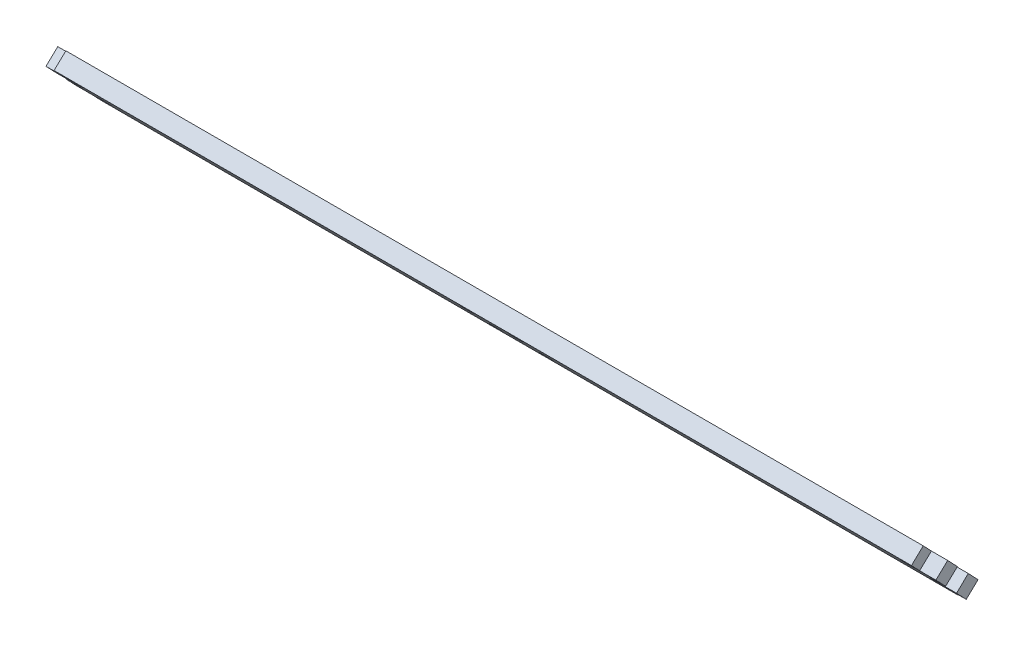
ISO-10303-21;
HEADER;
FILE_DESCRIPTION(('STEP AP214'),'2;1');
FILE_NAME('part.step','',(''),(''),'','','');
FILE_SCHEMA(('AUTOMOTIVE_DESIGN { 1 0 10303 214 1 1 1 1 }'));
ENDSEC;
DATA;
#1=APPLICATION_CONTEXT('core data for automotive mechanical design processes');
#2=APPLICATION_PROTOCOL_DEFINITION('international standard','automotive_design',2000,#1);
#3=PRODUCT_CONTEXT('',#1,'mechanical');
#4=PRODUCT('Part','Part','',(#3));
#5=PRODUCT_RELATED_PRODUCT_CATEGORY('part','',(#4));
#6=PRODUCT_DEFINITION_FORMATION('','',#4);
#7=PRODUCT_DEFINITION_CONTEXT('part definition',#1,'design');
#8=PRODUCT_DEFINITION('design','',#6,#7);
#9=PRODUCT_DEFINITION_SHAPE('','',#8);
#10=(LENGTH_UNIT() NAMED_UNIT(*) SI_UNIT(.MILLI.,.METRE.));
#11=(NAMED_UNIT(*) PLANE_ANGLE_UNIT() SI_UNIT($,.RADIAN.));
#12=(NAMED_UNIT(*) SI_UNIT($,.STERADIAN.) SOLID_ANGLE_UNIT());
#13=UNCERTAINTY_MEASURE_WITH_UNIT(LENGTH_MEASURE(1.E-05),#10,'distance_accuracy_value','');
#14=(GEOMETRIC_REPRESENTATION_CONTEXT(3) GLOBAL_UNCERTAINTY_ASSIGNED_CONTEXT((#13)) GLOBAL_UNIT_ASSIGNED_CONTEXT((#10,
#11,#12)) REPRESENTATION_CONTEXT('',''));
#15=CARTESIAN_POINT('',(0.,0.,0.));
#16=DIRECTION('',(0.,0.,1.));
#17=DIRECTION('',(1.,0.,0.));
#18=AXIS2_PLACEMENT_3D('',#15,#16,#17);
#19=CARTESIAN_POINT('',(112.61,-13.8103448544922,-20.6734883306936));
#20=DIRECTION('',(1.,0.,0.));
#21=DIRECTION('',(0.,0.,-1.));
#22=AXIS2_PLACEMENT_3D('',#19,#20,#21);
#23=PLANE('',#22);
#24=DIRECTION('',(0.,0.689700373188125,-0.724094879987534));
#25=VECTOR('',#24,1.);
#26=CARTESIAN_POINT('',(112.61,-10.3655169454699,-3.79577948372065));
#27=LINE('',#26,#25);
#28=CARTESIAN_POINT('',(112.61,-6.4099725615769,-7.94858198649548));
#29=VERTEX_POINT('',#28);
#30=CARTESIAN_POINT('',(112.61,-3.57530402777372,-10.9246119432442));
#31=VERTEX_POINT('',#30);
#32=EDGE_CURVE('E186',#29,#31,#27,.T.);
#33=ORIENTED_EDGE('',*,*,#32,.F.);
#34=DIRECTION('',(0.,0.724094879987534,0.689700373188125));
#35=VECTOR('',#34,1.);
#36=CARTESIAN_POINT('',(112.61,-16.6450133882954,-17.6974583739448));
#37=LINE('',#36,#35);
#38=CARTESIAN_POINT('',(112.61,-8.99316089497977,-10.4090688740617));
#39=VERTEX_POINT('',#38);
#40=EDGE_CURVE('E352',#39,#29,#37,.T.);
#41=ORIENTED_EDGE('',*,*,#40,.F.);
#42=DIRECTION('',(0.,0.689700373188125,-0.724094879987534));
#43=VECTOR('',#42,1.);
#44=CARTESIAN_POINT('',(112.61,-12.9487052788728,-6.25626637128688));
#45=LINE('',#44,#43);
#46=CARTESIAN_POINT('',(112.61,-6.15849236117659,-13.3850988308105));
#47=VERTEX_POINT('',#46);
#48=EDGE_CURVE('E216',#39,#47,#45,.T.);
#49=ORIENTED_EDGE('',*,*,#48,.T.);
#50=DIRECTION('',(0.,0.724094879987534,0.689700373188125));
#51=VECTOR('',#50,1.);
#52=CARTESIAN_POINT('',(112.61,-13.8103448544922,-20.6734883306936));
#53=LINE('',#52,#51);
#54=EDGE_CURVE('E358',#47,#31,#53,.T.);
#55=ORIENTED_EDGE('',*,*,#54,.T.);
#56=EDGE_LOOP('',(#33,#41,#49,#55));
#57=FACE_BOUND('',#56,.T.);
#58=ADVANCED_FACE('F33',(#57),#23,.T.);
#59=CARTESIAN_POINT('',(-112.61,-13.8103448544922,-20.6734883306936));
#60=DIRECTION('',(-1.,0.,0.));
#61=DIRECTION('',(0.,0.,1.));
#62=AXIS2_PLACEMENT_3D('',#59,#60,#61);
#63=PLANE('',#62);
#64=DIRECTION('',(0.,0.689700373188125,-0.724094879987534));
#65=VECTOR('',#64,1.);
#66=CARTESIAN_POINT('',(-112.61,-12.9487052788728,-6.25626637128686));
#67=LINE('',#66,#65);
#68=CARTESIAN_POINT('',(-112.61,-8.99316089497975,-10.4090688740617));
#69=VERTEX_POINT('',#68);
#70=CARTESIAN_POINT('',(-112.61,-6.15849236117657,-13.3850988308104));
#71=VERTEX_POINT('',#70);
#72=EDGE_CURVE('E253',#69,#71,#67,.T.);
#73=ORIENTED_EDGE('',*,*,#72,.F.);
#74=DIRECTION('',(0.,-0.724094879987534,-0.689700373188125));
#75=VECTOR('',#74,1.);
#76=CARTESIAN_POINT('',(-112.61,-16.6450133882954,-17.6974583739448));
#77=LINE('',#76,#75);
#78=CARTESIAN_POINT('',(-112.61,-6.40997256157689,-7.94858198649546));
#79=VERTEX_POINT('',#78);
#80=EDGE_CURVE('E370',#79,#69,#77,.T.);
#81=ORIENTED_EDGE('',*,*,#80,.F.);
#82=DIRECTION('',(0.,0.689700373188125,-0.724094879987534));
#83=VECTOR('',#82,1.);
#84=CARTESIAN_POINT('',(-112.61,-10.3655169454699,-3.79577948372063));
#85=LINE('',#84,#83);
#86=CARTESIAN_POINT('',(-112.61,-3.5753040277737,-10.9246119432442));
#87=VERTEX_POINT('',#86);
#88=EDGE_CURVE('E243',#79,#87,#85,.T.);
#89=ORIENTED_EDGE('',*,*,#88,.T.);
#90=DIRECTION('',(0.,-0.724094879987534,-0.689700373188125));
#91=VECTOR('',#90,1.);
#92=CARTESIAN_POINT('',(-112.61,-13.8103448544922,-20.6734883306936));
#93=LINE('',#92,#91);
#94=EDGE_CURVE('E42',#87,#71,#93,.T.);
#95=ORIENTED_EDGE('',*,*,#94,.T.);
#96=EDGE_LOOP('',(#73,#81,#89,#95));
#97=FACE_BOUND('',#96,.T.);
#98=ADVANCED_FACE('F432',(#97),#63,.T.);
#99=DIRECTION('',(0.,0.689700373188125,-0.724094879987534));
#100=VECTOR('',#99,1.);
#101=CARTESIAN_POINT('',(112.61,-15.845084798823,-9.01506786403941));
#102=LINE('',#101,#100);
#103=CARTESIAN_POINT('',(112.61,-11.8895404149299,-13.1678703668142));
#104=VERTEX_POINT('',#103);
#105=CARTESIAN_POINT('',(112.61,-9.05487188112676,-16.143900323563));
#106=VERTEX_POINT('',#105);
#107=EDGE_CURVE('E224',#104,#106,#102,.T.);
#108=ORIENTED_EDGE('',*,*,#107,.F.);
#109=CARTESIAN_POINT('',(112.61,-14.4727287483328,-15.6283572543805));
#110=VERTEX_POINT('',#109);
#111=EDGE_CURVE('E363',#110,#104,#37,.T.);
#112=ORIENTED_EDGE('',*,*,#111,.F.);
#113=DIRECTION('',(0.,0.689700373188125,-0.724094879987534));
#114=VECTOR('',#113,1.);
#115=CARTESIAN_POINT('',(112.61,-18.4282731322258,-11.4755547516056));
#116=LINE('',#115,#114);
#117=CARTESIAN_POINT('',(112.61,-11.6380602145296,-18.6043872111292));
#118=VERTEX_POINT('',#117);
#119=EDGE_CURVE('E295',#110,#118,#116,.T.);
#120=ORIENTED_EDGE('',*,*,#119,.T.);
#121=EDGE_CURVE('E355',#118,#106,#53,.T.);
#122=ORIENTED_EDGE('',*,*,#121,.T.);
#123=EDGE_LOOP('',(#108,#112,#120,#122));
#124=FACE_BOUND('',#123,.T.);
#125=ADVANCED_FACE('F35',(#124),#23,.T.);
#126=CARTESIAN_POINT('',(112.61,-13.8103448544922,-20.6734883306936));
#127=DIRECTION('',(0.,-0.724094879987534,-0.689700373188125));
#128=DIRECTION('',(0.,0.689700373188125,-0.724094879987534));
#129=AXIS2_PLACEMENT_3D('',#126,#127,#128);
#130=PLANE('',#129);
#131=DIRECTION('',(0.,0.689700373188125,-0.724094879987534));
#132=VECTOR('',#131,1.);
#133=CARTESIAN_POINT('',(-108.5,-20.6005577721884,-13.54465587117));
#134=LINE('',#133,#132);
#135=CARTESIAN_POINT('',(-108.5,-16.6450133882954,-17.6974583739448));
#136=VERTEX_POINT('',#135);
#137=CARTESIAN_POINT('',(-108.5,-13.8103448544922,-20.6734883306935));
#138=VERTEX_POINT('',#137);
#139=EDGE_CURVE('E58',#136,#138,#134,.T.);
#140=ORIENTED_EDGE('',*,*,#139,.T.);
#141=DIRECTION('',(1.,0.,0.));
#142=VECTOR('',#141,1.);
#143=CARTESIAN_POINT('',(112.61,-13.8103448544922,-20.6734883306936));
#144=LINE('',#143,#142);
#145=CARTESIAN_POINT('',(108.5,-13.8103448544922,-20.6734883306936));
#146=VERTEX_POINT('',#145);
#147=EDGE_CURVE('E11',#138,#146,#144,.T.);
#148=ORIENTED_EDGE('',*,*,#147,.T.);
#149=DIRECTION('',(0.,0.689700373188125,-0.724094879987534));
#150=VECTOR('',#149,1.);
#151=CARTESIAN_POINT('',(108.5,-20.6005577721884,-13.54465587117));
#152=LINE('',#151,#150);
#153=CARTESIAN_POINT('',(108.5,-16.6450133882954,-17.6974583739448));
#154=VERTEX_POINT('',#153);
#155=EDGE_CURVE('E300',#154,#146,#152,.T.);
#156=ORIENTED_EDGE('',*,*,#155,.F.);
#157=DIRECTION('',(1.,0.,0.));
#158=VECTOR('',#157,1.);
#159=CARTESIAN_POINT('',(112.61,-16.6450133882954,-17.6974583739448));
#160=LINE('',#159,#158);
#161=EDGE_CURVE('E37',#136,#154,#160,.T.);
#162=ORIENTED_EDGE('',*,*,#161,.F.);
#163=EDGE_LOOP('',(#140,#148,#156,#162));
#164=FACE_BOUND('',#163,.T.);
#165=ADVANCED_FACE('F404',(#164),#130,.T.);
#166=DIRECTION('',(0.,0.689700373188125,-0.724094879987534));
#167=VECTOR('',#166,1.);
#168=CARTESIAN_POINT('',(-112.61,-15.8450847988229,-9.0150678640394));
#169=LINE('',#168,#167);
#170=CARTESIAN_POINT('',(-112.61,-11.8895404149299,-13.1678703668142));
#171=VERTEX_POINT('',#170);
#172=CARTESIAN_POINT('',(-112.61,-9.05487188112675,-16.143900323563));
#173=VERTEX_POINT('',#172);
#174=EDGE_CURVE('E261',#171,#173,#169,.T.);
#175=ORIENTED_EDGE('',*,*,#174,.T.);
#176=CARTESIAN_POINT('',(-112.61,-11.6380602145296,-18.6043872111292));
#177=VERTEX_POINT('',#176);
#178=EDGE_CURVE('E360',#173,#177,#93,.T.);
#179=ORIENTED_EDGE('',*,*,#178,.T.);
#180=DIRECTION('',(0.,0.689700373188125,-0.724094879987534));
#181=VECTOR('',#180,1.);
#182=CARTESIAN_POINT('',(-112.61,-18.4282731322258,-11.4755547516056));
#183=LINE('',#182,#181);
#184=CARTESIAN_POINT('',(-112.61,-14.4727287483328,-15.6283572543805));
#185=VERTEX_POINT('',#184);
#186=EDGE_CURVE('E278',#185,#177,#183,.T.);
#187=ORIENTED_EDGE('',*,*,#186,.F.);
#188=EDGE_CURVE('E368',#171,#185,#77,.T.);
#189=ORIENTED_EDGE('',*,*,#188,.F.);
#190=EDGE_LOOP('',(#175,#179,#187,#189));
#191=FACE_BOUND('',#190,.T.);
#192=ADVANCED_FACE('F415',(#191),#63,.T.);
#193=CARTESIAN_POINT('',(112.61,-1.40301938781112,-8.85551082367985));
#194=DIRECTION('',(0.,0.724094879987534,0.689700373188125));
#195=DIRECTION('',(0.,-0.689700373188125,0.724094879987534));
#196=AXIS2_PLACEMENT_3D('',#193,#194,#195);
#197=PLANE('',#196);
#198=DIRECTION('',(0.,0.689700373188125,-0.724094879987534));
#199=VECTOR('',#198,1.);
#200=CARTESIAN_POINT('',(108.5,-8.19323230550736,-1.72667836415631));
#201=LINE('',#200,#199);
#202=CARTESIAN_POINT('',(108.5,-4.2376879216143,-5.8794808669311));
#203=VERTEX_POINT('',#202);
#204=CARTESIAN_POINT('',(108.5,-1.40301938781116,-8.85551082367989));
#205=VERTEX_POINT('',#204);
#206=EDGE_CURVE('E202',#203,#205,#201,.T.);
#207=ORIENTED_EDGE('',*,*,#206,.T.);
#208=DIRECTION('',(-1.,0.,0.));
#209=VECTOR('',#208,1.);
#210=CARTESIAN_POINT('',(112.61,-1.40301938781112,-8.85551082367985));
#211=LINE('',#210,#209);
#212=CARTESIAN_POINT('',(-108.5,-1.40301938781114,-8.85551082367987));
#213=VERTEX_POINT('',#212);
#214=EDGE_CURVE('E196',#205,#213,#211,.T.);
#215=ORIENTED_EDGE('',*,*,#214,.T.);
#216=DIRECTION('',(0.,0.689700373188125,-0.724094879987534));
#217=VECTOR('',#216,1.);
#218=CARTESIAN_POINT('',(-108.5,-8.19323230550734,-1.72667836415629));
#219=LINE('',#218,#217);
#220=CARTESIAN_POINT('',(-108.5,-4.23768792161432,-5.87948086693112));
#221=VERTEX_POINT('',#220);
#222=EDGE_CURVE('E246',#221,#213,#219,.T.);
#223=ORIENTED_EDGE('',*,*,#222,.F.);
#224=DIRECTION('',(-1.,0.,0.));
#225=VECTOR('',#224,1.);
#226=CARTESIAN_POINT('',(112.61,-4.2376879216143,-5.8794808669311));
#227=LINE('',#226,#225);
#228=EDGE_CURVE('E366',#203,#221,#227,.T.);
#229=ORIENTED_EDGE('',*,*,#228,.F.);
#230=EDGE_LOOP('',(#207,#215,#223,#229));
#231=FACE_BOUND('',#230,.T.);
#232=ADVANCED_FACE('F441',(#231),#197,.T.);
#233=CARTESIAN_POINT('',(0.,3.75511992743096,-3.94238312591177));
#234=DIRECTION('',(0.,-0.689700373188125,0.724094879987534));
#235=DIRECTION('',(0.,-0.724094879987534,-0.689700373188125));
#236=AXIS2_PLACEMENT_3D('',#233,#234,#235);
#237=PLANE('',#236);
#238=DIRECTION('',(0.,0.724094879987534,0.689700373188125));
#239=VECTOR('',#238,1.);
#240=CARTESIAN_POINT('',(108.5,-3.57530402777372,-10.9246119432442));
#241=LINE('',#240,#239);
#242=CARTESIAN_POINT('',(108.5,-3.57530402777372,-10.9246119432442));
#243=VERTEX_POINT('',#242);
#244=EDGE_CURVE('E174',#243,#205,#241,.T.);
#245=ORIENTED_EDGE('',*,*,#244,.F.);
#246=DIRECTION('',(-1.,0.,0.));
#247=VECTOR('',#246,1.);
#248=CARTESIAN_POINT('',(108.5,-3.57530402777372,-10.9246119432442));
#249=LINE('',#248,#247);
#250=EDGE_CURVE('E183',#31,#243,#249,.T.);
#251=ORIENTED_EDGE('',*,*,#250,.F.);
#252=ORIENTED_EDGE('',*,*,#54,.F.);
#253=DIRECTION('',(1.,0.,0.));
#254=VECTOR('',#253,1.);
#255=CARTESIAN_POINT('',(108.5,-6.15849236117659,-13.3850988308105));
#256=LINE('',#255,#254);
#257=CARTESIAN_POINT('',(108.5,-6.15849236117659,-13.3850988308105));
#258=VERTEX_POINT('',#257);
#259=EDGE_CURVE('E211',#258,#47,#256,.T.);
#260=ORIENTED_EDGE('',*,*,#259,.F.);
#261=DIRECTION('',(0.,0.724094879987534,0.689700373188125));
#262=VECTOR('',#261,1.);
#263=CARTESIAN_POINT('',(108.5,-9.05487188112676,-16.143900323563));
#264=LINE('',#263,#262);
#265=CARTESIAN_POINT('',(108.5,-9.05487188112676,-16.143900323563));
#266=VERTEX_POINT('',#265);
#267=EDGE_CURVE('E206',#266,#258,#264,.T.);
#268=ORIENTED_EDGE('',*,*,#267,.F.);
#269=DIRECTION('',(-1.,0.,0.));
#270=VECTOR('',#269,1.);
#271=CARTESIAN_POINT('',(108.5,-9.05487188112676,-16.143900323563));
#272=LINE('',#271,#270);
#273=EDGE_CURVE('E207',#106,#266,#272,.T.);
#274=ORIENTED_EDGE('',*,*,#273,.F.);
#275=ORIENTED_EDGE('',*,*,#121,.F.);
#276=DIRECTION('',(1.,0.,0.));
#277=VECTOR('',#276,1.);
#278=CARTESIAN_POINT('',(108.5,-11.6380602145296,-18.6043872111292));
#279=LINE('',#278,#277);
#280=CARTESIAN_POINT('',(108.5,-11.6380602145296,-18.6043872111292));
#281=VERTEX_POINT('',#280);
#282=EDGE_CURVE('E288',#281,#118,#279,.T.);
#283=ORIENTED_EDGE('',*,*,#282,.F.);
#284=DIRECTION('',(0.,0.724094879987534,0.689700373188125));
#285=VECTOR('',#284,1.);
#286=CARTESIAN_POINT('',(108.5,-11.6380602145296,-18.6043872111292));
#287=LINE('',#286,#285);
#288=EDGE_CURVE('E230',#146,#281,#287,.T.);
#289=ORIENTED_EDGE('',*,*,#288,.F.);
#290=ORIENTED_EDGE('',*,*,#147,.F.);
#291=DIRECTION('',(0.,-0.724094879987534,-0.689700373188125));
#292=VECTOR('',#291,1.);
#293=CARTESIAN_POINT('',(-108.5,-11.6380602145296,-18.6043872111292));
#294=LINE('',#293,#292);
#295=CARTESIAN_POINT('',(-108.5,-11.6380602145296,-18.6043872111292));
#296=VERTEX_POINT('',#295);
#297=EDGE_CURVE('E276',#296,#138,#294,.T.);
#298=ORIENTED_EDGE('',*,*,#297,.F.);
#299=DIRECTION('',(1.,0.,0.));
#300=VECTOR('',#299,1.);
#301=CARTESIAN_POINT('',(-108.5,-11.6380602145296,-18.6043872111292));
#302=LINE('',#301,#300);
#303=EDGE_CURVE('E275',#177,#296,#302,.T.);
#304=ORIENTED_EDGE('',*,*,#303,.F.);
#305=ORIENTED_EDGE('',*,*,#178,.F.);
#306=DIRECTION('',(-1.,0.,0.));
#307=VECTOR('',#306,1.);
#308=CARTESIAN_POINT('',(-108.5,-9.05487188112675,-16.143900323563));
#309=LINE('',#308,#307);
#310=CARTESIAN_POINT('',(-108.5,-9.05487188112675,-16.143900323563));
#311=VERTEX_POINT('',#310);
#312=EDGE_CURVE('E249',#311,#173,#309,.T.);
#313=ORIENTED_EDGE('',*,*,#312,.F.);
#314=DIRECTION('',(0.,-0.724094879987534,-0.689700373188125));
#315=VECTOR('',#314,1.);
#316=CARTESIAN_POINT('',(-108.5,-9.05487188112675,-16.143900323563));
#317=LINE('',#316,#315);
#318=CARTESIAN_POINT('',(-108.5,-6.15849236117657,-13.3850988308104));
#319=VERTEX_POINT('',#318);
#320=EDGE_CURVE('E250',#319,#311,#317,.T.);
#321=ORIENTED_EDGE('',*,*,#320,.F.);
#322=DIRECTION('',(1.,0.,0.));
#323=VECTOR('',#322,1.);
#324=CARTESIAN_POINT('',(-108.5,-6.15849236117657,-13.3850988308104));
#325=LINE('',#324,#323);
#326=EDGE_CURVE('E254',#71,#319,#325,.T.);
#327=ORIENTED_EDGE('',*,*,#326,.F.);
#328=ORIENTED_EDGE('',*,*,#94,.F.);
#329=DIRECTION('',(-1.,0.,0.));
#330=VECTOR('',#329,1.);
#331=CARTESIAN_POINT('',(-108.5,-3.57530402777371,-10.9246119432442));
#332=LINE('',#331,#330);
#333=CARTESIAN_POINT('',(-108.5,-3.57530402777371,-10.9246119432442));
#334=VERTEX_POINT('',#333);
#335=EDGE_CURVE('E231',#334,#87,#332,.T.);
#336=ORIENTED_EDGE('',*,*,#335,.F.);
#337=DIRECTION('',(0.,-0.724094879987534,-0.689700373188125));
#338=VECTOR('',#337,1.);
#339=CARTESIAN_POINT('',(-108.5,-3.57530402777371,-10.9246119432442));
#340=LINE('',#339,#338);
#341=EDGE_CURVE('E234',#213,#334,#340,.T.);
#342=ORIENTED_EDGE('',*,*,#341,.F.);
#343=ORIENTED_EDGE('',*,*,#214,.F.);
#344=EDGE_LOOP('',(#245,#251,#252,#260,#268,#274,#275,#283,#289,#290,#298,#304,#305,#313,#321,
#327,#328,#336,#342,#343));
#345=FACE_BOUND('',#344,.T.);
#346=CARTESIAN_POINT('',(-105.325,-11.5113436105318,-18.4836896458213));
#347=DIRECTION('',(0.,-0.689700373188125,0.724094879987534));
#348=DIRECTION('',(0.,0.724094879987534,0.689700373188125));
#349=AXIS2_PLACEMENT_3D('',#346,#347,#348);
#350=CIRCLE('',#349,1.5875);
#351=CARTESIAN_POINT('',(-105.325,-10.3618429885516,-17.3887903033852));
#352=VERTEX_POINT('',#351);
#353=EDGE_CURVE('E307',#352,#352,#350,.T.);
#354=ORIENTED_EDGE('',*,*,#353,.T.);
#355=EDGE_LOOP('',(#354));
#356=FACE_BOUND('',#355,.T.);
#357=CARTESIAN_POINT('',(105.325,-11.5113436105318,-18.4836896458213));
#358=DIRECTION('',(0.,-0.689700373188125,0.724094879987534));
#359=DIRECTION('',(0.,-0.724094879987534,-0.689700373188125));
#360=AXIS2_PLACEMENT_3D('',#357,#358,#359);
#361=CIRCLE('',#360,1.5875);
#362=CARTESIAN_POINT('',(105.325,-12.660844232512,-19.5785889882574));
#363=VERTEX_POINT('',#362);
#364=EDGE_CURVE('E313',#363,#363,#361,.T.);
#365=ORIENTED_EDGE('',*,*,#364,.T.);
#366=EDGE_LOOP('',(#365));
#367=FACE_BOUND('',#366,.T.);
#368=CARTESIAN_POINT('',(105.325,-3.70202063177154,-11.0453095085521));
#369=DIRECTION('',(0.,-0.689700373188125,0.724094879987534));
#370=DIRECTION('',(0.,0.724094879987534,0.689700373188125));
#371=AXIS2_PLACEMENT_3D('',#368,#369,#370);
#372=CIRCLE('',#371,1.5875);
#373=CARTESIAN_POINT('',(105.325,-2.55252000979133,-9.95041016611599));
#374=VERTEX_POINT('',#373);
#375=EDGE_CURVE('E319',#374,#374,#372,.T.);
#376=ORIENTED_EDGE('',*,*,#375,.T.);
#377=EDGE_LOOP('',(#376));
#378=FACE_BOUND('',#377,.T.);
#379=CARTESIAN_POINT('',(-105.325,-3.70202063177155,-11.0453095085522));
#380=DIRECTION('',(0.,-0.689700373188125,0.724094879987534));
#381=DIRECTION('',(0.,-0.724094879987534,-0.689700373188125));
#382=AXIS2_PLACEMENT_3D('',#379,#380,#381);
#383=CIRCLE('',#382,1.5875);
#384=CARTESIAN_POINT('',(-105.325,-4.85152125375176,-12.1402088509883));
#385=VERTEX_POINT('',#384);
#386=EDGE_CURVE('E325',#385,#385,#383,.T.);
#387=ORIENTED_EDGE('',*,*,#386,.T.);
#388=EDGE_LOOP('',(#387));
#389=FACE_BOUND('',#388,.T.);
#390=CARTESIAN_POINT('',(-6.29412277426879,-11.5113436105318,-18.4836896458213));
#391=DIRECTION('',(0.,-0.689700373188125,0.724094879987534));
#392=DIRECTION('',(0.,0.724094879987534,0.689700373188125));
#393=AXIS2_PLACEMENT_3D('',#390,#391,#392);
#394=CIRCLE('',#393,1.5875);
#395=CARTESIAN_POINT('',(-6.29412277426879,-10.3618429885516,-17.3887903033851));
#396=VERTEX_POINT('',#395);
#397=EDGE_CURVE('E331',#396,#396,#394,.T.);
#398=ORIENTED_EDGE('',*,*,#397,.T.);
#399=EDGE_LOOP('',(#398));
#400=FACE_BOUND('',#399,.T.);
#401=CARTESIAN_POINT('',(6.29412277426879,-11.5113436105318,-18.4836896458213));
#402=DIRECTION('',(0.,-0.689700373188125,0.724094879987534));
#403=DIRECTION('',(0.,-0.724094879987534,-0.689700373188125));
#404=AXIS2_PLACEMENT_3D('',#401,#402,#403);
#405=CIRCLE('',#404,1.5875);
#406=CARTESIAN_POINT('',(6.29412277426879,-12.660844232512,-19.5785889882574));
#407=VERTEX_POINT('',#406);
#408=EDGE_CURVE('E337',#407,#407,#405,.T.);
#409=ORIENTED_EDGE('',*,*,#408,.T.);
#410=EDGE_LOOP('',(#409));
#411=FACE_BOUND('',#410,.T.);
#412=CARTESIAN_POINT('',(6.29412277426878,-3.70202063177155,-11.0453095085522));
#413=DIRECTION('',(0.,-0.689700373188125,0.724094879987534));
#414=DIRECTION('',(0.,0.724094879987534,0.689700373188125));
#415=AXIS2_PLACEMENT_3D('',#412,#413,#414);
#416=CIRCLE('',#415,1.5875);
#417=CARTESIAN_POINT('',(6.29412277426878,-2.55252000979134,-9.950410166116));
#418=VERTEX_POINT('',#417);
#419=EDGE_CURVE('E343',#418,#418,#416,.T.);
#420=ORIENTED_EDGE('',*,*,#419,.T.);
#421=EDGE_LOOP('',(#420));
#422=FACE_BOUND('',#421,.T.);
#423=CARTESIAN_POINT('',(-6.29412277426879,-3.70202063177155,-11.0453095085522));
#424=DIRECTION('',(0.,-0.689700373188125,0.724094879987534));
#425=DIRECTION('',(0.,-0.724094879987534,-0.689700373188125));
#426=AXIS2_PLACEMENT_3D('',#423,#424,#425);
#427=CIRCLE('',#426,1.5875);
#428=CARTESIAN_POINT('',(-6.29412277426879,-4.85152125375176,-12.1402088509883));
#429=VERTEX_POINT('',#428);
#430=EDGE_CURVE('E349',#429,#429,#427,.T.);
#431=ORIENTED_EDGE('',*,*,#430,.T.);
#432=EDGE_LOOP('',(#431));
#433=FACE_BOUND('',#432,.T.);
#434=ADVANCED_FACE('F192',(#345,#356,#367,#378,#389,#400,#411,#422,#433),#237,.F.);
#435=CARTESIAN_POINT('',(0.,0.920451393627781,-0.966353169163026));
#436=DIRECTION('',(0.,-0.689700373188125,0.724094879987534));
#437=DIRECTION('',(0.,-0.724094879987534,-0.689700373188125));
#438=AXIS2_PLACEMENT_3D('',#435,#436,#437);
#439=PLANE('',#438);
#440=DIRECTION('',(-1.,0.,0.));
#441=VECTOR('',#440,1.);
#442=CARTESIAN_POINT('',(108.5,-6.40997256157691,-7.94858198649548));
#443=LINE('',#442,#441);
#444=CARTESIAN_POINT('',(108.5,-6.40997256157691,-7.94858198649548));
#445=VERTEX_POINT('',#444);
#446=EDGE_CURVE('E180',#29,#445,#443,.T.);
#447=ORIENTED_EDGE('',*,*,#446,.T.);
#448=DIRECTION('',(0.,0.724094879987534,0.689700373188125));
#449=VECTOR('',#448,1.);
#450=CARTESIAN_POINT('',(108.5,-6.40997256157691,-7.94858198649548));
#451=LINE('',#450,#449);
#452=EDGE_CURVE('E177',#445,#203,#451,.T.);
#453=ORIENTED_EDGE('',*,*,#452,.T.);
#454=ORIENTED_EDGE('',*,*,#228,.T.);
#455=DIRECTION('',(0.,-0.724094879987534,-0.689700373188125));
#456=VECTOR('',#455,1.);
#457=CARTESIAN_POINT('',(-108.5,-6.40997256157689,-7.94858198649546));
#458=LINE('',#457,#456);
#459=CARTESIAN_POINT('',(-108.5,-6.40997256157689,-7.94858198649546));
#460=VERTEX_POINT('',#459);
#461=EDGE_CURVE('E233',#221,#460,#458,.T.);
#462=ORIENTED_EDGE('',*,*,#461,.T.);
#463=DIRECTION('',(-1.,0.,0.));
#464=VECTOR('',#463,1.);
#465=CARTESIAN_POINT('',(-108.5,-6.40997256157689,-7.94858198649546));
#466=LINE('',#465,#464);
#467=EDGE_CURVE('E240',#460,#79,#466,.T.);
#468=ORIENTED_EDGE('',*,*,#467,.T.);
#469=ORIENTED_EDGE('',*,*,#80,.T.);
#470=DIRECTION('',(1.,0.,0.));
#471=VECTOR('',#470,1.);
#472=CARTESIAN_POINT('',(-108.5,-8.99316089497976,-10.4090688740617));
#473=LINE('',#472,#471);
#474=CARTESIAN_POINT('',(-108.5,-8.99316089497976,-10.4090688740617));
#475=VERTEX_POINT('',#474);
#476=EDGE_CURVE('E267',#69,#475,#473,.T.);
#477=ORIENTED_EDGE('',*,*,#476,.T.);
#478=DIRECTION('',(0.,-0.724094879987534,-0.689700373188125));
#479=VECTOR('',#478,1.);
#480=CARTESIAN_POINT('',(-108.5,-11.8895404149299,-13.1678703668142));
#481=LINE('',#480,#479);
#482=CARTESIAN_POINT('',(-108.5,-11.8895404149299,-13.1678703668142));
#483=VERTEX_POINT('',#482);
#484=EDGE_CURVE('E263',#475,#483,#481,.T.);
#485=ORIENTED_EDGE('',*,*,#484,.T.);
#486=DIRECTION('',(-1.,0.,0.));
#487=VECTOR('',#486,1.);
#488=CARTESIAN_POINT('',(-108.5,-11.8895404149299,-13.1678703668142));
#489=LINE('',#488,#487);
#490=EDGE_CURVE('E258',#483,#171,#489,.T.);
#491=ORIENTED_EDGE('',*,*,#490,.T.);
#492=ORIENTED_EDGE('',*,*,#188,.T.);
#493=DIRECTION('',(1.,0.,0.));
#494=VECTOR('',#493,1.);
#495=CARTESIAN_POINT('',(-108.5,-14.4727287483328,-15.6283572543805));
#496=LINE('',#495,#494);
#497=CARTESIAN_POINT('',(-108.5,-14.4727287483328,-15.6283572543805));
#498=VERTEX_POINT('',#497);
#499=EDGE_CURVE('E283',#185,#498,#496,.T.);
#500=ORIENTED_EDGE('',*,*,#499,.T.);
#501=DIRECTION('',(0.,-0.724094879987534,-0.689700373188125));
#502=VECTOR('',#501,1.);
#503=CARTESIAN_POINT('',(-108.5,-14.4727287483328,-15.6283572543805));
#504=LINE('',#503,#502);
#505=EDGE_CURVE('E198',#498,#136,#504,.T.);
#506=ORIENTED_EDGE('',*,*,#505,.T.);
#507=ORIENTED_EDGE('',*,*,#161,.T.);
#508=DIRECTION('',(0.,0.724094879987534,0.689700373188125));
#509=VECTOR('',#508,1.);
#510=CARTESIAN_POINT('',(108.5,-14.4727287483328,-15.6283572543805));
#511=LINE('',#510,#509);
#512=CARTESIAN_POINT('',(108.5,-14.4727287483328,-15.6283572543805));
#513=VERTEX_POINT('',#512);
#514=EDGE_CURVE('E296',#154,#513,#511,.T.);
#515=ORIENTED_EDGE('',*,*,#514,.T.);
#516=DIRECTION('',(1.,0.,0.));
#517=VECTOR('',#516,1.);
#518=CARTESIAN_POINT('',(108.5,-14.4727287483328,-15.6283572543805));
#519=LINE('',#518,#517);
#520=EDGE_CURVE('E290',#513,#110,#519,.T.);
#521=ORIENTED_EDGE('',*,*,#520,.T.);
#522=ORIENTED_EDGE('',*,*,#111,.T.);
#523=DIRECTION('',(-1.,0.,0.));
#524=VECTOR('',#523,1.);
#525=CARTESIAN_POINT('',(108.5,-11.8895404149299,-13.1678703668142));
#526=LINE('',#525,#524);
#527=CARTESIAN_POINT('',(108.5,-11.8895404149299,-13.1678703668142));
#528=VERTEX_POINT('',#527);
#529=EDGE_CURVE('E221',#104,#528,#526,.T.);
#530=ORIENTED_EDGE('',*,*,#529,.T.);
#531=DIRECTION('',(0.,0.724094879987534,0.689700373188125));
#532=VECTOR('',#531,1.);
#533=CARTESIAN_POINT('',(108.5,-11.8895404149299,-13.1678703668142));
#534=LINE('',#533,#532);
#535=CARTESIAN_POINT('',(108.5,-8.99316089497977,-10.4090688740617));
#536=VERTEX_POINT('',#535);
#537=EDGE_CURVE('E217',#528,#536,#534,.T.);
#538=ORIENTED_EDGE('',*,*,#537,.T.);
#539=DIRECTION('',(1.,0.,0.));
#540=VECTOR('',#539,1.);
#541=CARTESIAN_POINT('',(108.5,-8.99316089497977,-10.4090688740617));
#542=LINE('',#541,#540);
#543=EDGE_CURVE('E210',#536,#39,#542,.T.);
#544=ORIENTED_EDGE('',*,*,#543,.T.);
#545=ORIENTED_EDGE('',*,*,#40,.T.);
#546=EDGE_LOOP('',(#447,#453,#454,#462,#468,#469,#477,#485,#491,#492,#500,#506,#507,#515,#521,
#522,#530,#538,#544,#545));
#547=FACE_BOUND('',#546,.T.);
#548=CARTESIAN_POINT('',(-105.325,-14.346012144335,-15.5076596890726));
#549=DIRECTION('',(0.,-0.689700373188125,0.724094879987534));
#550=DIRECTION('',(0.,0.724094879987534,0.689700373188125));
#551=AXIS2_PLACEMENT_3D('',#548,#549,#550);
#552=CIRCLE('',#551,1.5875);
#553=CARTESIAN_POINT('',(-105.325,-13.1965115223548,-14.4127603466364));
#554=VERTEX_POINT('',#553);
#555=EDGE_CURVE('E306',#554,#554,#552,.T.);
#556=ORIENTED_EDGE('',*,*,#555,.F.);
#557=EDGE_LOOP('',(#556));
#558=FACE_BOUND('',#557,.T.);
#559=CARTESIAN_POINT('',(105.325,-14.346012144335,-15.5076596890725));
#560=DIRECTION('',(0.,-0.689700373188125,0.724094879987534));
#561=DIRECTION('',(0.,-0.724094879987534,-0.689700373188125));
#562=AXIS2_PLACEMENT_3D('',#559,#560,#561);
#563=CIRCLE('',#562,1.5875);
#564=CARTESIAN_POINT('',(105.325,-15.4955127663152,-16.6025590315087));
#565=VERTEX_POINT('',#564);
#566=EDGE_CURVE('E310',#565,#565,#563,.T.);
#567=ORIENTED_EDGE('',*,*,#566,.F.);
#568=EDGE_LOOP('',(#567));
#569=FACE_BOUND('',#568,.T.);
#570=CARTESIAN_POINT('',(105.325,-6.53668916557471,-8.06927955180339));
#571=DIRECTION('',(0.,-0.689700373188125,0.724094879987534));
#572=DIRECTION('',(0.,0.724094879987534,0.689700373188125));
#573=AXIS2_PLACEMENT_3D('',#570,#571,#572);
#574=CIRCLE('',#573,1.5875);
#575=CARTESIAN_POINT('',(105.325,-5.3871885435945,-6.97438020936724));
#576=VERTEX_POINT('',#575);
#577=EDGE_CURVE('E316',#576,#576,#574,.T.);
#578=ORIENTED_EDGE('',*,*,#577,.F.);
#579=EDGE_LOOP('',(#578));
#580=FACE_BOUND('',#579,.T.);
#581=CARTESIAN_POINT('',(-105.325,-6.53668916557473,-8.06927955180341));
#582=DIRECTION('',(0.,-0.689700373188125,0.724094879987534));
#583=DIRECTION('',(0.,-0.724094879987534,-0.689700373188125));
#584=AXIS2_PLACEMENT_3D('',#581,#582,#583);
#585=CIRCLE('',#584,1.5875);
#586=CARTESIAN_POINT('',(-105.325,-7.68618978755494,-9.16417889423956));
#587=VERTEX_POINT('',#586);
#588=EDGE_CURVE('E322',#587,#587,#585,.T.);
#589=ORIENTED_EDGE('',*,*,#588,.F.);
#590=EDGE_LOOP('',(#589));
#591=FACE_BOUND('',#590,.T.);
#592=CARTESIAN_POINT('',(-6.29412277426879,-14.346012144335,-15.5076596890725));
#593=DIRECTION('',(0.,-0.689700373188125,0.724094879987534));
#594=DIRECTION('',(0.,0.724094879987534,0.689700373188125));
#595=AXIS2_PLACEMENT_3D('',#592,#593,#594);
#596=CIRCLE('',#595,1.5875);
#597=CARTESIAN_POINT('',(-6.29412277426879,-13.1965115223548,-14.4127603466364));
#598=VERTEX_POINT('',#597);
#599=EDGE_CURVE('E328',#598,#598,#596,.T.);
#600=ORIENTED_EDGE('',*,*,#599,.F.);
#601=EDGE_LOOP('',(#600));
#602=FACE_BOUND('',#601,.T.);
#603=CARTESIAN_POINT('',(6.29412277426879,-14.346012144335,-15.5076596890725));
#604=DIRECTION('',(0.,-0.689700373188125,0.724094879987534));
#605=DIRECTION('',(0.,-0.724094879987534,-0.689700373188125));
#606=AXIS2_PLACEMENT_3D('',#603,#604,#605);
#607=CIRCLE('',#606,1.5875);
#608=CARTESIAN_POINT('',(6.29412277426879,-15.4955127663152,-16.6025590315087));
#609=VERTEX_POINT('',#608);
#610=EDGE_CURVE('E334',#609,#609,#607,.T.);
#611=ORIENTED_EDGE('',*,*,#610,.F.);
#612=EDGE_LOOP('',(#611));
#613=FACE_BOUND('',#612,.T.);
#614=CARTESIAN_POINT('',(6.29412277426878,-6.53668916557473,-8.0692795518034));
#615=DIRECTION('',(0.,-0.689700373188125,0.724094879987534));
#616=DIRECTION('',(0.,0.724094879987534,0.689700373188125));
#617=AXIS2_PLACEMENT_3D('',#614,#615,#616);
#618=CIRCLE('',#617,1.5875);
#619=CARTESIAN_POINT('',(6.29412277426878,-5.38718854359452,-6.97438020936726));
#620=VERTEX_POINT('',#619);
#621=EDGE_CURVE('E340',#620,#620,#618,.T.);
#622=ORIENTED_EDGE('',*,*,#621,.F.);
#623=EDGE_LOOP('',(#622));
#624=FACE_BOUND('',#623,.T.);
#625=CARTESIAN_POINT('',(-6.29412277426879,-6.53668916557473,-8.0692795518034));
#626=DIRECTION('',(0.,-0.689700373188125,0.724094879987534));
#627=DIRECTION('',(0.,-0.724094879987534,-0.689700373188125));
#628=AXIS2_PLACEMENT_3D('',#625,#626,#627);
#629=CIRCLE('',#628,1.5875);
#630=CARTESIAN_POINT('',(-6.29412277426879,-7.68618978755494,-9.16417889423956));
#631=VERTEX_POINT('',#630);
#632=EDGE_CURVE('E346',#631,#631,#629,.T.);
#633=ORIENTED_EDGE('',*,*,#632,.F.);
#634=EDGE_LOOP('',(#633));
#635=FACE_BOUND('',#634,.T.);
#636=ADVANCED_FACE('F397',(#547,#558,#569,#580,#591,#602,#613,#624,#635),#439,.T.);
#637=CARTESIAN_POINT('',(-6.29412277426879,-3.70202063177155,-11.0453095085522));
#638=DIRECTION('',(0.,-0.689700373188125,0.724094879987534));
#639=DIRECTION('',(0.,-0.724094879987534,-0.689700373188125));
#640=AXIS2_PLACEMENT_3D('',#637,#638,#639);
#641=CYLINDRICAL_SURFACE('',#640,1.5875);
#642=ORIENTED_EDGE('',*,*,#430,.F.);
#643=EDGE_LOOP('',(#642));
#644=FACE_BOUND('',#643,.T.);
#645=ORIENTED_EDGE('',*,*,#632,.T.);
#646=EDGE_LOOP('',(#645));
#647=FACE_BOUND('',#646,.T.);
#648=ADVANCED_FACE('F462',(#644,#647),#641,.F.);
#649=CARTESIAN_POINT('',(6.29412277426878,-3.70202063177155,-11.0453095085522));
#650=DIRECTION('',(0.,-0.689700373188125,0.724094879987534));
#651=DIRECTION('',(0.,-0.724094879987534,-0.689700373188125));
#652=AXIS2_PLACEMENT_3D('',#649,#650,#651);
#653=CYLINDRICAL_SURFACE('',#652,1.5875);
#654=ORIENTED_EDGE('',*,*,#419,.F.);
#655=EDGE_LOOP('',(#654));
#656=FACE_BOUND('',#655,.T.);
#657=ORIENTED_EDGE('',*,*,#621,.T.);
#658=EDGE_LOOP('',(#657));
#659=FACE_BOUND('',#658,.T.);
#660=ADVANCED_FACE('F466',(#656,#659),#653,.F.);
#661=CARTESIAN_POINT('',(6.29412277426879,-11.5113436105318,-18.4836896458213));
#662=DIRECTION('',(0.,-0.689700373188125,0.724094879987534));
#663=DIRECTION('',(0.,-0.724094879987534,-0.689700373188125));
#664=AXIS2_PLACEMENT_3D('',#661,#662,#663);
#665=CYLINDRICAL_SURFACE('',#664,1.5875);
#666=ORIENTED_EDGE('',*,*,#408,.F.);
#667=EDGE_LOOP('',(#666));
#668=FACE_BOUND('',#667,.T.);
#669=ORIENTED_EDGE('',*,*,#610,.T.);
#670=EDGE_LOOP('',(#669));
#671=FACE_BOUND('',#670,.T.);
#672=ADVANCED_FACE('F470',(#668,#671),#665,.F.);
#673=CARTESIAN_POINT('',(-6.29412277426879,-11.5113436105318,-18.4836896458213));
#674=DIRECTION('',(0.,-0.689700373188125,0.724094879987534));
#675=DIRECTION('',(0.,-0.724094879987534,-0.689700373188125));
#676=AXIS2_PLACEMENT_3D('',#673,#674,#675);
#677=CYLINDRICAL_SURFACE('',#676,1.5875);
#678=ORIENTED_EDGE('',*,*,#397,.F.);
#679=EDGE_LOOP('',(#678));
#680=FACE_BOUND('',#679,.T.);
#681=ORIENTED_EDGE('',*,*,#599,.T.);
#682=EDGE_LOOP('',(#681));
#683=FACE_BOUND('',#682,.T.);
#684=ADVANCED_FACE('F474',(#680,#683),#677,.F.);
#685=CARTESIAN_POINT('',(-105.325,-3.70202063177155,-11.0453095085522));
#686=DIRECTION('',(0.,-0.689700373188125,0.724094879987534));
#687=DIRECTION('',(0.,-0.724094879987534,-0.689700373188125));
#688=AXIS2_PLACEMENT_3D('',#685,#686,#687);
#689=CYLINDRICAL_SURFACE('',#688,1.5875);
#690=ORIENTED_EDGE('',*,*,#386,.F.);
#691=EDGE_LOOP('',(#690));
#692=FACE_BOUND('',#691,.T.);
#693=ORIENTED_EDGE('',*,*,#588,.T.);
#694=EDGE_LOOP('',(#693));
#695=FACE_BOUND('',#694,.T.);
#696=ADVANCED_FACE('F478',(#692,#695),#689,.F.);
#697=CARTESIAN_POINT('',(105.325,-3.70202063177154,-11.0453095085521));
#698=DIRECTION('',(0.,-0.689700373188125,0.724094879987534));
#699=DIRECTION('',(0.,-0.724094879987534,-0.689700373188125));
#700=AXIS2_PLACEMENT_3D('',#697,#698,#699);
#701=CYLINDRICAL_SURFACE('',#700,1.5875);
#702=ORIENTED_EDGE('',*,*,#375,.F.);
#703=EDGE_LOOP('',(#702));
#704=FACE_BOUND('',#703,.T.);
#705=ORIENTED_EDGE('',*,*,#577,.T.);
#706=EDGE_LOOP('',(#705));
#707=FACE_BOUND('',#706,.T.);
#708=ADVANCED_FACE('F482',(#704,#707),#701,.F.);
#709=CARTESIAN_POINT('',(105.325,-11.5113436105318,-18.4836896458213));
#710=DIRECTION('',(0.,-0.689700373188125,0.724094879987534));
#711=DIRECTION('',(0.,-0.724094879987534,-0.689700373188125));
#712=AXIS2_PLACEMENT_3D('',#709,#710,#711);
#713=CYLINDRICAL_SURFACE('',#712,1.5875);
#714=ORIENTED_EDGE('',*,*,#364,.F.);
#715=EDGE_LOOP('',(#714));
#716=FACE_BOUND('',#715,.T.);
#717=ORIENTED_EDGE('',*,*,#566,.T.);
#718=EDGE_LOOP('',(#717));
#719=FACE_BOUND('',#718,.T.);
#720=ADVANCED_FACE('F486',(#716,#719),#713,.F.);
#721=CARTESIAN_POINT('',(-105.325,-11.5113436105318,-18.4836896458213));
#722=DIRECTION('',(0.,-0.689700373188125,0.724094879987534));
#723=DIRECTION('',(0.,-0.724094879987534,-0.689700373188125));
#724=AXIS2_PLACEMENT_3D('',#721,#722,#723);
#725=CYLINDRICAL_SURFACE('',#724,1.5875);
#726=ORIENTED_EDGE('',*,*,#353,.F.);
#727=EDGE_LOOP('',(#726));
#728=FACE_BOUND('',#727,.T.);
#729=ORIENTED_EDGE('',*,*,#555,.T.);
#730=EDGE_LOOP('',(#729));
#731=FACE_BOUND('',#730,.T.);
#732=ADVANCED_FACE('F490',(#728,#731),#725,.F.);
#733=CARTESIAN_POINT('',(108.5,-18.4282731322258,-11.4755547516056));
#734=DIRECTION('',(0.,0.724094879987534,0.689700373188125));
#735=DIRECTION('',(0.,-0.689700373188125,0.724094879987534));
#736=AXIS2_PLACEMENT_3D('',#733,#734,#735);
#737=PLANE('',#736);
#738=DIRECTION('',(0.,0.689700373188125,-0.724094879987534));
#739=VECTOR('',#738,1.);
#740=CARTESIAN_POINT('',(108.5,-18.4282731322258,-11.4755547516056));
#741=LINE('',#740,#739);
#742=EDGE_CURVE('E299',#513,#281,#741,.T.);
#743=ORIENTED_EDGE('',*,*,#742,.T.);
#744=ORIENTED_EDGE('',*,*,#282,.T.);
#745=ORIENTED_EDGE('',*,*,#119,.F.);
#746=ORIENTED_EDGE('',*,*,#520,.F.);
#747=EDGE_LOOP('',(#743,#744,#745,#746));
#748=FACE_BOUND('',#747,.T.);
#749=ADVANCED_FACE('F396',(#748),#737,.F.);
#750=CARTESIAN_POINT('',(108.5,-18.4282731322258,-11.4755547516056));
#751=DIRECTION('',(-1.,0.,0.));
#752=DIRECTION('',(0.,0.,1.));
#753=AXIS2_PLACEMENT_3D('',#750,#751,#752);
#754=PLANE('',#753);
#755=ORIENTED_EDGE('',*,*,#155,.T.);
#756=ORIENTED_EDGE('',*,*,#288,.T.);
#757=ORIENTED_EDGE('',*,*,#742,.F.);
#758=ORIENTED_EDGE('',*,*,#514,.F.);
#759=EDGE_LOOP('',(#755,#756,#757,#758));
#760=FACE_BOUND('',#759,.T.);
#761=ADVANCED_FACE('F401',(#760),#754,.F.);
#762=CARTESIAN_POINT('',(-108.5,-18.4282731322258,-11.4755547516056));
#763=DIRECTION('',(0.,0.724094879987534,0.689700373188125));
#764=DIRECTION('',(0.,-0.689700373188125,0.724094879987534));
#765=AXIS2_PLACEMENT_3D('',#762,#763,#764);
#766=PLANE('',#765);
#767=ORIENTED_EDGE('',*,*,#186,.T.);
#768=ORIENTED_EDGE('',*,*,#303,.T.);
#769=DIRECTION('',(0.,0.689700373188125,-0.724094879987534));
#770=VECTOR('',#769,1.);
#771=CARTESIAN_POINT('',(-108.5,-18.4282731322258,-11.4755547516056));
#772=LINE('',#771,#770);
#773=EDGE_CURVE('E282',#498,#296,#772,.T.);
#774=ORIENTED_EDGE('',*,*,#773,.F.);
#775=ORIENTED_EDGE('',*,*,#499,.F.);
#776=EDGE_LOOP('',(#767,#768,#774,#775));
#777=FACE_BOUND('',#776,.T.);
#778=ADVANCED_FACE('F412',(#777),#766,.F.);
#779=CARTESIAN_POINT('',(-108.5,-18.4282731322258,-11.4755547516056));
#780=DIRECTION('',(1.,0.,0.));
#781=DIRECTION('',(0.,0.,-1.));
#782=AXIS2_PLACEMENT_3D('',#779,#780,#781);
#783=PLANE('',#782);
#784=ORIENTED_EDGE('',*,*,#773,.T.);
#785=ORIENTED_EDGE('',*,*,#297,.T.);
#786=ORIENTED_EDGE('',*,*,#139,.F.);
#787=ORIENTED_EDGE('',*,*,#505,.F.);
#788=EDGE_LOOP('',(#784,#785,#786,#787));
#789=FACE_BOUND('',#788,.T.);
#790=ADVANCED_FACE('F409',(#789),#783,.F.);
#791=CARTESIAN_POINT('',(-108.5,-10.3655169454699,-3.79577948372063));
#792=DIRECTION('',(1.,0.,0.));
#793=DIRECTION('',(0.,0.,-1.));
#794=AXIS2_PLACEMENT_3D('',#791,#792,#793);
#795=PLANE('',#794);
#796=ORIENTED_EDGE('',*,*,#222,.T.);
#797=ORIENTED_EDGE('',*,*,#341,.T.);
#798=DIRECTION('',(0.,0.689700373188125,-0.724094879987534));
#799=VECTOR('',#798,1.);
#800=CARTESIAN_POINT('',(-108.5,-10.3655169454699,-3.79577948372063));
#801=LINE('',#800,#799);
#802=EDGE_CURVE('E239',#460,#334,#801,.T.);
#803=ORIENTED_EDGE('',*,*,#802,.F.);
#804=ORIENTED_EDGE('',*,*,#461,.F.);
#805=EDGE_LOOP('',(#796,#797,#803,#804));
#806=FACE_BOUND('',#805,.T.);
#807=ADVANCED_FACE('F439',(#806),#795,.F.);
#808=CARTESIAN_POINT('',(-108.5,-10.3655169454699,-3.79577948372063));
#809=DIRECTION('',(0.,-0.724094879987534,-0.689700373188125));
#810=DIRECTION('',(0.,0.689700373188125,-0.724094879987534));
#811=AXIS2_PLACEMENT_3D('',#808,#809,#810);
#812=PLANE('',#811);
#813=ORIENTED_EDGE('',*,*,#802,.T.);
#814=ORIENTED_EDGE('',*,*,#335,.T.);
#815=ORIENTED_EDGE('',*,*,#88,.F.);
#816=ORIENTED_EDGE('',*,*,#467,.F.);
#817=EDGE_LOOP('',(#813,#814,#815,#816));
#818=FACE_BOUND('',#817,.T.);
#819=ADVANCED_FACE('F434',(#818),#812,.F.);
#820=CARTESIAN_POINT('',(-108.5,-12.9487052788728,-6.25626637128686));
#821=DIRECTION('',(0.,0.724094879987534,0.689700373188125));
#822=DIRECTION('',(0.,-0.689700373188125,0.724094879987534));
#823=AXIS2_PLACEMENT_3D('',#820,#821,#822);
#824=PLANE('',#823);
#825=ORIENTED_EDGE('',*,*,#72,.T.);
#826=ORIENTED_EDGE('',*,*,#326,.T.);
#827=DIRECTION('',(0.,0.689700373188125,-0.724094879987534));
#828=VECTOR('',#827,1.);
#829=CARTESIAN_POINT('',(-108.5,-12.9487052788728,-6.25626637128686));
#830=LINE('',#829,#828);
#831=EDGE_CURVE('E266',#475,#319,#830,.T.);
#832=ORIENTED_EDGE('',*,*,#831,.F.);
#833=ORIENTED_EDGE('',*,*,#476,.F.);
#834=EDGE_LOOP('',(#825,#826,#832,#833));
#835=FACE_BOUND('',#834,.T.);
#836=ADVANCED_FACE('F426',(#835),#824,.F.);
#837=CARTESIAN_POINT('',(-108.5,-15.8450847988229,-9.0150678640394));
#838=DIRECTION('',(1.,0.,0.));
#839=DIRECTION('',(0.,0.,-1.));
#840=AXIS2_PLACEMENT_3D('',#837,#838,#839);
#841=PLANE('',#840);
#842=ORIENTED_EDGE('',*,*,#831,.T.);
#843=ORIENTED_EDGE('',*,*,#320,.T.);
#844=DIRECTION('',(0.,0.689700373188125,-0.724094879987534));
#845=VECTOR('',#844,1.);
#846=CARTESIAN_POINT('',(-108.5,-15.8450847988229,-9.0150678640394));
#847=LINE('',#846,#845);
#848=EDGE_CURVE('E262',#483,#311,#847,.T.);
#849=ORIENTED_EDGE('',*,*,#848,.F.);
#850=ORIENTED_EDGE('',*,*,#484,.F.);
#851=EDGE_LOOP('',(#842,#843,#849,#850));
#852=FACE_BOUND('',#851,.T.);
#853=ADVANCED_FACE('F423',(#852),#841,.F.);
#854=CARTESIAN_POINT('',(-108.5,-15.8450847988229,-9.0150678640394));
#855=DIRECTION('',(0.,-0.724094879987534,-0.689700373188125));
#856=DIRECTION('',(0.,0.689700373188125,-0.724094879987534));
#857=AXIS2_PLACEMENT_3D('',#854,#855,#856);
#858=PLANE('',#857);
#859=ORIENTED_EDGE('',*,*,#848,.T.);
#860=ORIENTED_EDGE('',*,*,#312,.T.);
#861=ORIENTED_EDGE('',*,*,#174,.F.);
#862=ORIENTED_EDGE('',*,*,#490,.F.);
#863=EDGE_LOOP('',(#859,#860,#861,#862));
#864=FACE_BOUND('',#863,.T.);
#865=ADVANCED_FACE('F420',(#864),#858,.F.);
#866=CARTESIAN_POINT('',(108.5,-12.9487052788728,-6.25626637128688));
#867=DIRECTION('',(0.,0.724094879987534,0.689700373188125));
#868=DIRECTION('',(0.,-0.689700373188125,0.724094879987534));
#869=AXIS2_PLACEMENT_3D('',#866,#867,#868);
#870=PLANE('',#869);
#871=DIRECTION('',(0.,0.689700373188125,-0.724094879987534));
#872=VECTOR('',#871,1.);
#873=CARTESIAN_POINT('',(108.5,-12.9487052788728,-6.25626637128688));
#874=LINE('',#873,#872);
#875=EDGE_CURVE('E50',#536,#258,#874,.T.);
#876=ORIENTED_EDGE('',*,*,#875,.T.);
#877=ORIENTED_EDGE('',*,*,#259,.T.);
#878=ORIENTED_EDGE('',*,*,#48,.F.);
#879=ORIENTED_EDGE('',*,*,#543,.F.);
#880=EDGE_LOOP('',(#876,#877,#878,#879));
#881=FACE_BOUND('',#880,.T.);
#882=ADVANCED_FACE('F384',(#881),#870,.F.);
#883=CARTESIAN_POINT('',(108.5,-15.845084798823,-9.01506786403941));
#884=DIRECTION('',(0.,-0.724094879987534,-0.689700373188125));
#885=DIRECTION('',(0.,0.689700373188125,-0.724094879987534));
#886=AXIS2_PLACEMENT_3D('',#883,#884,#885);
#887=PLANE('',#886);
#888=ORIENTED_EDGE('',*,*,#107,.T.);
#889=ORIENTED_EDGE('',*,*,#273,.T.);
#890=DIRECTION('',(0.,0.689700373188125,-0.724094879987534));
#891=VECTOR('',#890,1.);
#892=CARTESIAN_POINT('',(108.5,-15.845084798823,-9.01506786403941));
#893=LINE('',#892,#891);
#894=EDGE_CURVE('E220',#528,#266,#893,.T.);
#895=ORIENTED_EDGE('',*,*,#894,.F.);
#896=ORIENTED_EDGE('',*,*,#529,.F.);
#897=EDGE_LOOP('',(#888,#889,#895,#896));
#898=FACE_BOUND('',#897,.T.);
#899=ADVANCED_FACE('F388',(#898),#887,.F.);
#900=CARTESIAN_POINT('',(108.5,-15.845084798823,-9.01506786403941));
#901=DIRECTION('',(-1.,0.,0.));
#902=DIRECTION('',(0.,0.,1.));
#903=AXIS2_PLACEMENT_3D('',#900,#901,#902);
#904=PLANE('',#903);
#905=ORIENTED_EDGE('',*,*,#894,.T.);
#906=ORIENTED_EDGE('',*,*,#267,.T.);
#907=ORIENTED_EDGE('',*,*,#875,.F.);
#908=ORIENTED_EDGE('',*,*,#537,.F.);
#909=EDGE_LOOP('',(#905,#906,#907,#908));
#910=FACE_BOUND('',#909,.T.);
#911=ADVANCED_FACE('F385',(#910),#904,.F.);
#912=CARTESIAN_POINT('',(108.5,-10.3655169454699,-3.79577948372065));
#913=DIRECTION('',(0.,-0.724094879987534,-0.689700373188125));
#914=DIRECTION('',(0.,0.689700373188125,-0.724094879987534));
#915=AXIS2_PLACEMENT_3D('',#912,#913,#914);
#916=PLANE('',#915);
#917=ORIENTED_EDGE('',*,*,#32,.T.);
#918=ORIENTED_EDGE('',*,*,#250,.T.);
#919=DIRECTION('',(0.,0.689700373188125,-0.724094879987534));
#920=VECTOR('',#919,1.);
#921=CARTESIAN_POINT('',(108.5,-10.3655169454699,-3.79577948372065));
#922=LINE('',#921,#920);
#923=EDGE_CURVE('E170',#445,#243,#922,.T.);
#924=ORIENTED_EDGE('',*,*,#923,.F.);
#925=ORIENTED_EDGE('',*,*,#446,.F.);
#926=EDGE_LOOP('',(#917,#918,#924,#925));
#927=FACE_BOUND('',#926,.T.);
#928=ADVANCED_FACE('F184',(#927),#916,.F.);
#929=CARTESIAN_POINT('',(108.5,-10.3655169454699,-3.79577948372065));
#930=DIRECTION('',(-1.,0.,0.));
#931=DIRECTION('',(0.,0.,1.));
#932=AXIS2_PLACEMENT_3D('',#929,#930,#931);
#933=PLANE('',#932);
#934=ORIENTED_EDGE('',*,*,#923,.T.);
#935=ORIENTED_EDGE('',*,*,#244,.T.);
#936=ORIENTED_EDGE('',*,*,#206,.F.);
#937=ORIENTED_EDGE('',*,*,#452,.F.);
#938=EDGE_LOOP('',(#934,#935,#936,#937));
#939=FACE_BOUND('',#938,.T.);
#940=ADVANCED_FACE('F172',(#939),#933,.F.);
#941=CLOSED_SHELL('',(#58,#98,#125,#165,#192,#232,#434,#636,#648,#660,#672,#684,#696,#708,#720,
#732,#749,#761,#778,#790,#807,#819,#836,#853,#865,#882,#899,#911,#928,#940));
#942=MANIFOLD_SOLID_BREP('B2',#941);
#943=ADVANCED_BREP_SHAPE_REPRESENTATION('',(#18,#942),#14);
#944=SHAPE_DEFINITION_REPRESENTATION(#9,#943);
ENDSEC;
END-ISO-10303-21;
